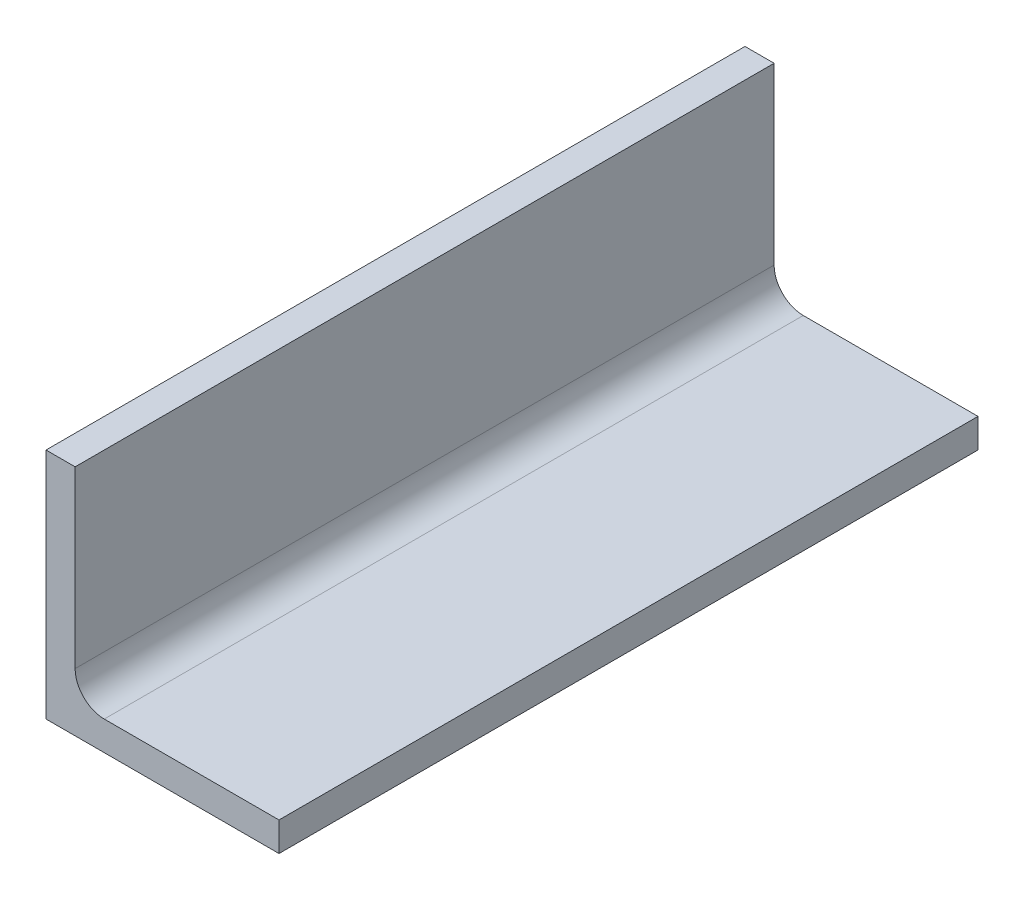
ISO-10303-21;
HEADER;
FILE_DESCRIPTION(('STEP AP214'),'2;1');
FILE_NAME('part.step','',(''),(''),'','','');
FILE_SCHEMA(('AUTOMOTIVE_DESIGN { 1 0 10303 214 1 1 1 1 }'));
ENDSEC;
DATA;
#1=APPLICATION_CONTEXT('core data for automotive mechanical design processes');
#2=APPLICATION_PROTOCOL_DEFINITION('international standard','automotive_design',2000,#1);
#3=PRODUCT_CONTEXT('',#1,'mechanical');
#4=PRODUCT('Part','Part','',(#3));
#5=PRODUCT_RELATED_PRODUCT_CATEGORY('part','',(#4));
#6=PRODUCT_DEFINITION_FORMATION('','',#4);
#7=PRODUCT_DEFINITION_CONTEXT('part definition',#1,'design');
#8=PRODUCT_DEFINITION('design','',#6,#7);
#9=PRODUCT_DEFINITION_SHAPE('','',#8);
#10=(LENGTH_UNIT() NAMED_UNIT(*) SI_UNIT(.MILLI.,.METRE.));
#11=(NAMED_UNIT(*) PLANE_ANGLE_UNIT() SI_UNIT($,.RADIAN.));
#12=(NAMED_UNIT(*) SI_UNIT($,.STERADIAN.) SOLID_ANGLE_UNIT());
#13=UNCERTAINTY_MEASURE_WITH_UNIT(LENGTH_MEASURE(1.E-05),#10,'distance_accuracy_value','');
#14=(GEOMETRIC_REPRESENTATION_CONTEXT(3) GLOBAL_UNCERTAINTY_ASSIGNED_CONTEXT((#13)) GLOBAL_UNIT_ASSIGNED_CONTEXT((#10,
#11,#12)) REPRESENTATION_CONTEXT('',''));
#15=CARTESIAN_POINT('',(0.,0.,0.));
#16=DIRECTION('',(0.,0.,1.));
#17=DIRECTION('',(1.,0.,0.));
#18=AXIS2_PLACEMENT_3D('',#15,#16,#17);
#19=CARTESIAN_POINT('',(50.8,0.,76.2));
#20=DIRECTION('',(0.,1.,0.));
#21=DIRECTION('',(-1.,0.,0.));
#22=AXIS2_PLACEMENT_3D('',#19,#20,#21);
#23=PLANE('',#22);
#24=DIRECTION('',(1.,0.,0.));
#25=VECTOR('',#24,1.);
#26=CARTESIAN_POINT('',(50.8,0.,-76.2));
#27=LINE('',#26,#25);
#28=CARTESIAN_POINT('',(0.,0.,-76.2));
#29=VERTEX_POINT('',#28);
#30=CARTESIAN_POINT('',(50.8,0.,-76.2));
#31=VERTEX_POINT('',#30);
#32=EDGE_CURVE('E124',#29,#31,#27,.T.);
#33=ORIENTED_EDGE('',*,*,#32,.T.);
#34=DIRECTION('',(0.,0.,-1.));
#35=VECTOR('',#34,1.);
#36=CARTESIAN_POINT('',(50.8,0.,76.2));
#37=LINE('',#36,#35);
#38=CARTESIAN_POINT('',(50.8,0.,76.2));
#39=VERTEX_POINT('',#38);
#40=EDGE_CURVE('E11',#39,#31,#37,.T.);
#41=ORIENTED_EDGE('',*,*,#40,.F.);
#42=DIRECTION('',(1.,0.,0.));
#43=VECTOR('',#42,1.);
#44=CARTESIAN_POINT('',(50.8,0.,76.2));
#45=LINE('',#44,#43);
#46=CARTESIAN_POINT('',(0.,0.,76.2));
#47=VERTEX_POINT('',#46);
#48=EDGE_CURVE('E136',#47,#39,#45,.T.);
#49=ORIENTED_EDGE('',*,*,#48,.F.);
#50=DIRECTION('',(0.,0.,-1.));
#51=VECTOR('',#50,1.);
#52=CARTESIAN_POINT('',(0.,0.,76.2));
#53=LINE('',#52,#51);
#54=EDGE_CURVE('E120',#47,#29,#53,.T.);
#55=ORIENTED_EDGE('',*,*,#54,.T.);
#56=EDGE_LOOP('',(#33,#41,#49,#55));
#57=FACE_BOUND('',#56,.T.);
#58=ADVANCED_FACE('F34',(#57),#23,.F.);
#59=CARTESIAN_POINT('',(50.8,6.35000000000001,76.2));
#60=DIRECTION('',(-1.,0.,0.));
#61=DIRECTION('',(0.,0.,1.));
#62=AXIS2_PLACEMENT_3D('',#59,#60,#61);
#63=PLANE('',#62);
#64=DIRECTION('',(0.,1.,0.));
#65=VECTOR('',#64,1.);
#66=CARTESIAN_POINT('',(50.8,6.35000000000001,-76.2));
#67=LINE('',#66,#65);
#68=CARTESIAN_POINT('',(50.8,6.35000000000001,-76.2));
#69=VERTEX_POINT('',#68);
#70=EDGE_CURVE('E127',#31,#69,#67,.T.);
#71=ORIENTED_EDGE('',*,*,#70,.T.);
#72=DIRECTION('',(0.,0.,-1.));
#73=VECTOR('',#72,1.);
#74=CARTESIAN_POINT('',(50.8,6.35000000000001,76.2));
#75=LINE('',#74,#73);
#76=CARTESIAN_POINT('',(50.8,6.35000000000001,76.2));
#77=VERTEX_POINT('',#76);
#78=EDGE_CURVE('E42',#77,#69,#75,.T.);
#79=ORIENTED_EDGE('',*,*,#78,.F.);
#80=DIRECTION('',(0.,1.,0.));
#81=VECTOR('',#80,1.);
#82=CARTESIAN_POINT('',(50.8,6.35000000000001,76.2));
#83=LINE('',#82,#81);
#84=EDGE_CURVE('E90',#39,#77,#83,.T.);
#85=ORIENTED_EDGE('',*,*,#84,.F.);
#86=ORIENTED_EDGE('',*,*,#40,.T.);
#87=EDGE_LOOP('',(#71,#79,#85,#86));
#88=FACE_BOUND('',#87,.T.);
#89=ADVANCED_FACE('F161',(#88),#63,.F.);
#90=CARTESIAN_POINT('',(12.7,6.35000000000001,76.2));
#91=DIRECTION('',(0.,-1.,0.));
#92=DIRECTION('',(0.,0.,-1.));
#93=AXIS2_PLACEMENT_3D('',#90,#91,#92);
#94=PLANE('',#93);
#95=DIRECTION('',(-1.,0.,0.));
#96=VECTOR('',#95,1.);
#97=CARTESIAN_POINT('',(12.7,6.35000000000001,-76.2));
#98=LINE('',#97,#96);
#99=CARTESIAN_POINT('',(12.7,6.35000000000001,-76.2));
#100=VERTEX_POINT('',#99);
#101=EDGE_CURVE('E129',#69,#100,#98,.T.);
#102=ORIENTED_EDGE('',*,*,#101,.T.);
#103=DIRECTION('',(0.,0.,-1.));
#104=VECTOR('',#103,1.);
#105=CARTESIAN_POINT('',(12.7,6.35000000000001,76.2));
#106=LINE('',#105,#104);
#107=CARTESIAN_POINT('',(12.7,6.35000000000001,76.2));
#108=VERTEX_POINT('',#107);
#109=EDGE_CURVE('E140',#108,#100,#106,.T.);
#110=ORIENTED_EDGE('',*,*,#109,.F.);
#111=DIRECTION('',(-1.,0.,0.));
#112=VECTOR('',#111,1.);
#113=CARTESIAN_POINT('',(12.7,6.35000000000001,76.2));
#114=LINE('',#113,#112);
#115=EDGE_CURVE('E148',#77,#108,#114,.T.);
#116=ORIENTED_EDGE('',*,*,#115,.F.);
#117=ORIENTED_EDGE('',*,*,#78,.T.);
#118=EDGE_LOOP('',(#102,#110,#116,#117));
#119=FACE_BOUND('',#118,.T.);
#120=ADVANCED_FACE('F146',(#119),#94,.F.);
#121=CARTESIAN_POINT('',(12.7,12.7,76.2));
#122=DIRECTION('',(0.,0.,-1.));
#123=DIRECTION('',(-1.,0.,0.));
#124=AXIS2_PLACEMENT_3D('',#121,#122,#123);
#125=CYLINDRICAL_SURFACE('',#124,6.35);
#126=CARTESIAN_POINT('',(12.7,12.7,-76.2));
#127=DIRECTION('',(0.,0.,-1.));
#128=DIRECTION('',(-1.,0.,0.));
#129=AXIS2_PLACEMENT_3D('',#126,#127,#128);
#130=CIRCLE('',#129,6.35);
#131=CARTESIAN_POINT('',(6.35,12.7,-76.2));
#132=VERTEX_POINT('',#131);
#133=EDGE_CURVE('E131',#100,#132,#130,.T.);
#134=ORIENTED_EDGE('',*,*,#133,.T.);
#135=DIRECTION('',(0.,0.,-1.));
#136=VECTOR('',#135,1.);
#137=CARTESIAN_POINT('',(6.35,12.7,76.2));
#138=LINE('',#137,#136);
#139=CARTESIAN_POINT('',(6.35,12.7,76.2));
#140=VERTEX_POINT('',#139);
#141=EDGE_CURVE('E115',#140,#132,#138,.T.);
#142=ORIENTED_EDGE('',*,*,#141,.F.);
#143=CARTESIAN_POINT('',(12.7,12.7,76.2));
#144=DIRECTION('',(0.,0.,-1.));
#145=DIRECTION('',(-1.,0.,0.));
#146=AXIS2_PLACEMENT_3D('',#143,#144,#145);
#147=CIRCLE('',#146,6.35);
#148=EDGE_CURVE('E106',#108,#140,#147,.T.);
#149=ORIENTED_EDGE('',*,*,#148,.F.);
#150=ORIENTED_EDGE('',*,*,#109,.T.);
#151=EDGE_LOOP('',(#134,#142,#149,#150));
#152=FACE_BOUND('',#151,.T.);
#153=ADVANCED_FACE('F154',(#152),#125,.F.);
#154=CARTESIAN_POINT('',(6.35,50.8,76.2));
#155=DIRECTION('',(-1.,0.,0.));
#156=DIRECTION('',(0.,-1.,0.));
#157=AXIS2_PLACEMENT_3D('',#154,#155,#156);
#158=PLANE('',#157);
#159=DIRECTION('',(0.,1.,0.));
#160=VECTOR('',#159,1.);
#161=CARTESIAN_POINT('',(6.35,50.8,-76.2));
#162=LINE('',#161,#160);
#163=CARTESIAN_POINT('',(6.35,50.8,-76.2));
#164=VERTEX_POINT('',#163);
#165=EDGE_CURVE('E114',#132,#164,#162,.T.);
#166=ORIENTED_EDGE('',*,*,#165,.T.);
#167=DIRECTION('',(0.,0.,-1.));
#168=VECTOR('',#167,1.);
#169=CARTESIAN_POINT('',(6.35,50.8,76.2));
#170=LINE('',#169,#168);
#171=CARTESIAN_POINT('',(6.35,50.8,76.2));
#172=VERTEX_POINT('',#171);
#173=EDGE_CURVE('E111',#172,#164,#170,.T.);
#174=ORIENTED_EDGE('',*,*,#173,.F.);
#175=DIRECTION('',(0.,1.,0.));
#176=VECTOR('',#175,1.);
#177=CARTESIAN_POINT('',(6.35,50.8,76.2));
#178=LINE('',#177,#176);
#179=EDGE_CURVE('E100',#140,#172,#178,.T.);
#180=ORIENTED_EDGE('',*,*,#179,.F.);
#181=ORIENTED_EDGE('',*,*,#141,.T.);
#182=EDGE_LOOP('',(#166,#174,#180,#181));
#183=FACE_BOUND('',#182,.T.);
#184=ADVANCED_FACE('F112',(#183),#158,.F.);
#185=CARTESIAN_POINT('',(0.,50.8,76.2));
#186=DIRECTION('',(0.,-1.,0.));
#187=DIRECTION('',(0.,0.,-1.));
#188=AXIS2_PLACEMENT_3D('',#185,#186,#187);
#189=PLANE('',#188);
#190=DIRECTION('',(-1.,0.,0.));
#191=VECTOR('',#190,1.);
#192=CARTESIAN_POINT('',(0.,50.8,-76.2));
#193=LINE('',#192,#191);
#194=CARTESIAN_POINT('',(0.,50.8,-76.2));
#195=VERTEX_POINT('',#194);
#196=EDGE_CURVE('E76',#164,#195,#193,.T.);
#197=ORIENTED_EDGE('',*,*,#196,.T.);
#198=DIRECTION('',(0.,0.,-1.));
#199=VECTOR('',#198,1.);
#200=CARTESIAN_POINT('',(0.,50.8,76.2));
#201=LINE('',#200,#199);
#202=CARTESIAN_POINT('',(0.,50.8,76.2));
#203=VERTEX_POINT('',#202);
#204=EDGE_CURVE('E116',#203,#195,#201,.T.);
#205=ORIENTED_EDGE('',*,*,#204,.F.);
#206=DIRECTION('',(-1.,0.,0.));
#207=VECTOR('',#206,1.);
#208=CARTESIAN_POINT('',(0.,50.8,76.2));
#209=LINE('',#208,#207);
#210=EDGE_CURVE('E104',#172,#203,#209,.T.);
#211=ORIENTED_EDGE('',*,*,#210,.F.);
#212=ORIENTED_EDGE('',*,*,#173,.T.);
#213=EDGE_LOOP('',(#197,#205,#211,#212));
#214=FACE_BOUND('',#213,.T.);
#215=ADVANCED_FACE('F118',(#214),#189,.F.);
#216=CARTESIAN_POINT('',(0.,0.,76.2));
#217=DIRECTION('',(1.,0.,0.));
#218=DIRECTION('',(0.,0.,-1.));
#219=AXIS2_PLACEMENT_3D('',#216,#217,#218);
#220=PLANE('',#219);
#221=DIRECTION('',(0.,-1.,0.));
#222=VECTOR('',#221,1.);
#223=CARTESIAN_POINT('',(0.,0.,-76.2));
#224=LINE('',#223,#222);
#225=EDGE_CURVE('E82',#195,#29,#224,.T.);
#226=ORIENTED_EDGE('',*,*,#225,.T.);
#227=ORIENTED_EDGE('',*,*,#54,.F.);
#228=DIRECTION('',(0.,-1.,0.));
#229=VECTOR('',#228,1.);
#230=CARTESIAN_POINT('',(0.,0.,76.2));
#231=LINE('',#230,#229);
#232=EDGE_CURVE('E50',#203,#47,#231,.T.);
#233=ORIENTED_EDGE('',*,*,#232,.F.);
#234=ORIENTED_EDGE('',*,*,#204,.T.);
#235=EDGE_LOOP('',(#226,#227,#233,#234));
#236=FACE_BOUND('',#235,.T.);
#237=ADVANCED_FACE('F175',(#236),#220,.F.);
#238=CARTESIAN_POINT('',(12.7,12.7,76.2));
#239=DIRECTION('',(0.,0.,-1.));
#240=DIRECTION('',(-1.,0.,0.));
#241=AXIS2_PLACEMENT_3D('',#238,#239,#240);
#242=PLANE('',#241);
#243=ORIENTED_EDGE('',*,*,#48,.T.);
#244=ORIENTED_EDGE('',*,*,#84,.T.);
#245=ORIENTED_EDGE('',*,*,#115,.T.);
#246=ORIENTED_EDGE('',*,*,#148,.T.);
#247=ORIENTED_EDGE('',*,*,#179,.T.);
#248=ORIENTED_EDGE('',*,*,#210,.T.);
#249=ORIENTED_EDGE('',*,*,#232,.T.);
#250=EDGE_LOOP('',(#243,#244,#245,#246,#247,#248,#249));
#251=FACE_BOUND('',#250,.T.);
#252=ADVANCED_FACE('F102',(#251),#242,.F.);
#253=CARTESIAN_POINT('',(12.7,12.7,-76.2));
#254=DIRECTION('',(0.,0.,-1.));
#255=DIRECTION('',(-1.,0.,0.));
#256=AXIS2_PLACEMENT_3D('',#253,#254,#255);
#257=PLANE('',#256);
#258=ORIENTED_EDGE('',*,*,#32,.F.);
#259=ORIENTED_EDGE('',*,*,#225,.F.);
#260=ORIENTED_EDGE('',*,*,#196,.F.);
#261=ORIENTED_EDGE('',*,*,#165,.F.);
#262=ORIENTED_EDGE('',*,*,#133,.F.);
#263=ORIENTED_EDGE('',*,*,#101,.F.);
#264=ORIENTED_EDGE('',*,*,#70,.F.);
#265=EDGE_LOOP('',(#258,#259,#260,#261,#262,#263,#264));
#266=FACE_BOUND('',#265,.T.);
#267=ADVANCED_FACE('F152',(#266),#257,.T.);
#268=CLOSED_SHELL('',(#58,#89,#120,#153,#184,#215,#237,#252,#267));
#269=MANIFOLD_SOLID_BREP('B2',#268);
#270=ADVANCED_BREP_SHAPE_REPRESENTATION('',(#18,#269),#14);
#271=SHAPE_DEFINITION_REPRESENTATION(#9,#270);
ENDSEC;
END-ISO-10303-21;
